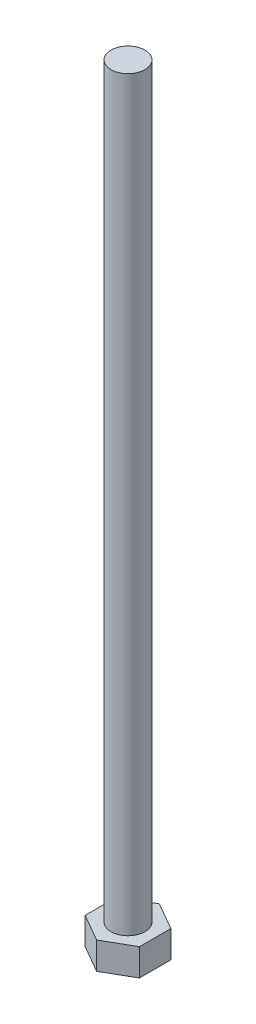
ISO-10303-21;
HEADER;
FILE_DESCRIPTION(('STEP AP214'),'2;1');
FILE_NAME('part.step','',(''),(''),'','','');
FILE_SCHEMA(('AUTOMOTIVE_DESIGN { 1 0 10303 214 1 1 1 1 }'));
ENDSEC;
DATA;
#1=APPLICATION_CONTEXT('core data for automotive mechanical design processes');
#2=APPLICATION_PROTOCOL_DEFINITION('international standard','automotive_design',2000,#1);
#3=PRODUCT_CONTEXT('',#1,'mechanical');
#4=PRODUCT('Part','Part','',(#3));
#5=PRODUCT_RELATED_PRODUCT_CATEGORY('part','',(#4));
#6=PRODUCT_DEFINITION_FORMATION('','',#4);
#7=PRODUCT_DEFINITION_CONTEXT('part definition',#1,'design');
#8=PRODUCT_DEFINITION('design','',#6,#7);
#9=PRODUCT_DEFINITION_SHAPE('','',#8);
#10=(LENGTH_UNIT() NAMED_UNIT(*) SI_UNIT(.MILLI.,.METRE.));
#11=(NAMED_UNIT(*) PLANE_ANGLE_UNIT() SI_UNIT($,.RADIAN.));
#12=(NAMED_UNIT(*) SI_UNIT($,.STERADIAN.) SOLID_ANGLE_UNIT());
#13=UNCERTAINTY_MEASURE_WITH_UNIT(LENGTH_MEASURE(1.E-05),#10,'distance_accuracy_value','');
#14=(GEOMETRIC_REPRESENTATION_CONTEXT(3) GLOBAL_UNCERTAINTY_ASSIGNED_CONTEXT((#13)) GLOBAL_UNIT_ASSIGNED_CONTEXT((#10,
#11,#12)) REPRESENTATION_CONTEXT('',''));
#15=CARTESIAN_POINT('',(0.,0.,0.));
#16=DIRECTION('',(0.,0.,1.));
#17=DIRECTION('',(1.,0.,0.));
#18=AXIS2_PLACEMENT_3D('',#15,#16,#17);
#19=CARTESIAN_POINT('',(0.,4.,4.61880215351705));
#20=DIRECTION('',(-0.499999999999999,0.,-0.866025403784439));
#21=DIRECTION('',(-0.866025403784439,0.,0.499999999999999));
#22=AXIS2_PLACEMENT_3D('',#19,#20,#21);
#23=PLANE('',#22);
#24=DIRECTION('',(0.866025403784439,0.,-0.499999999999999));
#25=VECTOR('',#24,1.);
#26=CARTESIAN_POINT('',(0.,0.,4.61880215351705));
#27=LINE('',#26,#25);
#28=CARTESIAN_POINT('',(0.,0.,4.61880215351705));
#29=VERTEX_POINT('',#28);
#30=CARTESIAN_POINT('',(4.00000000000003,0.,2.30940107675853));
#31=VERTEX_POINT('',#30);
#32=EDGE_CURVE('E119',#29,#31,#27,.T.);
#33=ORIENTED_EDGE('',*,*,#32,.T.);
#34=DIRECTION('',(0.,-1.,0.));
#35=VECTOR('',#34,1.);
#36=CARTESIAN_POINT('',(4.00000000000003,4.,2.30940107675853));
#37=LINE('',#36,#35);
#38=CARTESIAN_POINT('',(4.00000000000003,4.,2.30940107675853));
#39=VERTEX_POINT('',#38);
#40=EDGE_CURVE('E36',#39,#31,#37,.T.);
#41=ORIENTED_EDGE('',*,*,#40,.F.);
#42=DIRECTION('',(0.866025403784439,0.,-0.499999999999999));
#43=VECTOR('',#42,1.);
#44=CARTESIAN_POINT('',(0.,4.,4.61880215351705));
#45=LINE('',#44,#43);
#46=CARTESIAN_POINT('',(0.,4.,4.61880215351705));
#47=VERTEX_POINT('',#46);
#48=EDGE_CURVE('E130',#47,#39,#45,.T.);
#49=ORIENTED_EDGE('',*,*,#48,.F.);
#50=DIRECTION('',(0.,-1.,0.));
#51=VECTOR('',#50,1.);
#52=CARTESIAN_POINT('',(0.,4.,4.61880215351705));
#53=LINE('',#52,#51);
#54=EDGE_CURVE('E115',#47,#29,#53,.T.);
#55=ORIENTED_EDGE('',*,*,#54,.T.);
#56=EDGE_LOOP('',(#33,#41,#49,#55));
#57=FACE_BOUND('',#56,.T.);
#58=ADVANCED_FACE('F33',(#57),#23,.F.);
#59=CARTESIAN_POINT('',(4.00000000000003,4.,2.30940107675853));
#60=DIRECTION('',(-1.,0.,0.));
#61=DIRECTION('',(0.,0.,1.));
#62=AXIS2_PLACEMENT_3D('',#59,#60,#61);
#63=PLANE('',#62);
#64=DIRECTION('',(0.,0.,-1.));
#65=VECTOR('',#64,1.);
#66=CARTESIAN_POINT('',(4.00000000000003,0.,2.30940107675853));
#67=LINE('',#66,#65);
#68=CARTESIAN_POINT('',(4.00000000000004,0.,-2.30940107675852));
#69=VERTEX_POINT('',#68);
#70=EDGE_CURVE('E122',#31,#69,#67,.T.);
#71=ORIENTED_EDGE('',*,*,#70,.T.);
#72=DIRECTION('',(0.,-1.,0.));
#73=VECTOR('',#72,1.);
#74=CARTESIAN_POINT('',(4.00000000000004,4.,-2.30940107675852));
#75=LINE('',#74,#73);
#76=CARTESIAN_POINT('',(4.00000000000004,4.,-2.30940107675852));
#77=VERTEX_POINT('',#76);
#78=EDGE_CURVE('E133',#77,#69,#75,.T.);
#79=ORIENTED_EDGE('',*,*,#78,.F.);
#80=DIRECTION('',(0.,0.,-1.));
#81=VECTOR('',#80,1.);
#82=CARTESIAN_POINT('',(4.00000000000003,4.,2.30940107675853));
#83=LINE('',#82,#81);
#84=EDGE_CURVE('E88',#39,#77,#83,.T.);
#85=ORIENTED_EDGE('',*,*,#84,.F.);
#86=ORIENTED_EDGE('',*,*,#40,.T.);
#87=EDGE_LOOP('',(#71,#79,#85,#86));
#88=FACE_BOUND('',#87,.T.);
#89=ADVANCED_FACE('F138',(#88),#63,.F.);
#90=CARTESIAN_POINT('',(4.00000000000004,4.,-2.30940107675852));
#91=DIRECTION('',(-0.500000000000001,0.,0.866025403784438));
#92=DIRECTION('',(0.866025403784438,0.,0.500000000000001));
#93=AXIS2_PLACEMENT_3D('',#90,#91,#92);
#94=PLANE('',#93);
#95=DIRECTION('',(-0.866025403784438,0.,-0.500000000000001));
#96=VECTOR('',#95,1.);
#97=CARTESIAN_POINT('',(4.00000000000004,0.,-2.30940107675852));
#98=LINE('',#97,#96);
#99=CARTESIAN_POINT('',(0.,0.,-4.61880215351705));
#100=VERTEX_POINT('',#99);
#101=EDGE_CURVE('E125',#69,#100,#98,.T.);
#102=ORIENTED_EDGE('',*,*,#101,.T.);
#103=DIRECTION('',(0.,-1.,0.));
#104=VECTOR('',#103,1.);
#105=CARTESIAN_POINT('',(0.,4.,-4.61880215351705));
#106=LINE('',#105,#104);
#107=CARTESIAN_POINT('',(0.,4.,-4.61880215351705));
#108=VERTEX_POINT('',#107);
#109=EDGE_CURVE('E110',#108,#100,#106,.T.);
#110=ORIENTED_EDGE('',*,*,#109,.F.);
#111=DIRECTION('',(-0.866025403784438,0.,-0.500000000000001));
#112=VECTOR('',#111,1.);
#113=CARTESIAN_POINT('',(4.00000000000004,4.,-2.30940107675852));
#114=LINE('',#113,#112);
#115=EDGE_CURVE('E101',#77,#108,#114,.T.);
#116=ORIENTED_EDGE('',*,*,#115,.F.);
#117=ORIENTED_EDGE('',*,*,#78,.T.);
#118=EDGE_LOOP('',(#102,#110,#116,#117));
#119=FACE_BOUND('',#118,.T.);
#120=ADVANCED_FACE('F144',(#119),#94,.F.);
#121=CARTESIAN_POINT('',(0.,4.,-4.61880215351705));
#122=DIRECTION('',(0.499999999999999,0.,0.866025403784439));
#123=DIRECTION('',(0.866025403784439,0.,-0.499999999999999));
#124=AXIS2_PLACEMENT_3D('',#121,#122,#123);
#125=PLANE('',#124);
#126=DIRECTION('',(-0.866025403784439,0.,0.499999999999999));
#127=VECTOR('',#126,1.);
#128=CARTESIAN_POINT('',(0.,0.,-4.61880215351705));
#129=LINE('',#128,#127);
#130=CARTESIAN_POINT('',(-4.00000000000003,0.,-2.30940107675853));
#131=VERTEX_POINT('',#130);
#132=EDGE_CURVE('E109',#100,#131,#129,.T.);
#133=ORIENTED_EDGE('',*,*,#132,.T.);
#134=DIRECTION('',(0.,-1.,0.));
#135=VECTOR('',#134,1.);
#136=CARTESIAN_POINT('',(-4.00000000000003,4.,-2.30940107675853));
#137=LINE('',#136,#135);
#138=CARTESIAN_POINT('',(-4.00000000000003,4.,-2.30940107675853));
#139=VERTEX_POINT('',#138);
#140=EDGE_CURVE('E106',#139,#131,#137,.T.);
#141=ORIENTED_EDGE('',*,*,#140,.F.);
#142=DIRECTION('',(-0.866025403784439,0.,0.499999999999999));
#143=VECTOR('',#142,1.);
#144=CARTESIAN_POINT('',(0.,4.,-4.61880215351705));
#145=LINE('',#144,#143);
#146=EDGE_CURVE('E95',#108,#139,#145,.T.);
#147=ORIENTED_EDGE('',*,*,#146,.F.);
#148=ORIENTED_EDGE('',*,*,#109,.T.);
#149=EDGE_LOOP('',(#133,#141,#147,#148));
#150=FACE_BOUND('',#149,.T.);
#151=ADVANCED_FACE('F107',(#150),#125,.F.);
#152=CARTESIAN_POINT('',(-4.00000000000003,4.,-2.30940107675853));
#153=DIRECTION('',(1.,0.,0.));
#154=DIRECTION('',(0.,0.,-1.));
#155=AXIS2_PLACEMENT_3D('',#152,#153,#154);
#156=PLANE('',#155);
#157=DIRECTION('',(0.,0.,1.));
#158=VECTOR('',#157,1.);
#159=CARTESIAN_POINT('',(-4.00000000000003,0.,-2.30940107675853));
#160=LINE('',#159,#158);
#161=CARTESIAN_POINT('',(-4.00000000000004,0.,2.30940107675852));
#162=VERTEX_POINT('',#161);
#163=EDGE_CURVE('E73',#131,#162,#160,.T.);
#164=ORIENTED_EDGE('',*,*,#163,.T.);
#165=DIRECTION('',(0.,-1.,0.));
#166=VECTOR('',#165,1.);
#167=CARTESIAN_POINT('',(-4.00000000000004,4.,2.30940107675852));
#168=LINE('',#167,#166);
#169=CARTESIAN_POINT('',(-4.00000000000004,4.,2.30940107675852));
#170=VERTEX_POINT('',#169);
#171=EDGE_CURVE('E111',#170,#162,#168,.T.);
#172=ORIENTED_EDGE('',*,*,#171,.F.);
#173=DIRECTION('',(0.,0.,1.));
#174=VECTOR('',#173,1.);
#175=CARTESIAN_POINT('',(-4.00000000000003,4.,-2.30940107675853));
#176=LINE('',#175,#174);
#177=EDGE_CURVE('E99',#139,#170,#176,.T.);
#178=ORIENTED_EDGE('',*,*,#177,.F.);
#179=ORIENTED_EDGE('',*,*,#140,.T.);
#180=EDGE_LOOP('',(#164,#172,#178,#179));
#181=FACE_BOUND('',#180,.T.);
#182=ADVANCED_FACE('F113',(#181),#156,.F.);
#183=CARTESIAN_POINT('',(-4.00000000000004,4.,2.30940107675852));
#184=DIRECTION('',(0.500000000000001,0.,-0.866025403784438));
#185=DIRECTION('',(-0.866025403784438,0.,-0.500000000000001));
#186=AXIS2_PLACEMENT_3D('',#183,#184,#185);
#187=PLANE('',#186);
#188=DIRECTION('',(0.866025403784438,0.,0.500000000000001));
#189=VECTOR('',#188,1.);
#190=CARTESIAN_POINT('',(-4.00000000000004,0.,2.30940107675852));
#191=LINE('',#190,#189);
#192=EDGE_CURVE('E79',#162,#29,#191,.T.);
#193=ORIENTED_EDGE('',*,*,#192,.T.);
#194=ORIENTED_EDGE('',*,*,#54,.F.);
#195=DIRECTION('',(0.866025403784438,0.,0.500000000000001));
#196=VECTOR('',#195,1.);
#197=CARTESIAN_POINT('',(-4.00000000000004,4.,2.30940107675852));
#198=LINE('',#197,#196);
#199=EDGE_CURVE('E50',#170,#47,#198,.T.);
#200=ORIENTED_EDGE('',*,*,#199,.F.);
#201=ORIENTED_EDGE('',*,*,#171,.T.);
#202=EDGE_LOOP('',(#193,#194,#200,#201));
#203=FACE_BOUND('',#202,.T.);
#204=ADVANCED_FACE('F160',(#203),#187,.F.);
#205=CARTESIAN_POINT('',(0.,4.,0.));
#206=DIRECTION('',(0.,1.,0.));
#207=DIRECTION('',(0.,0.,1.));
#208=AXIS2_PLACEMENT_3D('',#205,#206,#207);
#209=PLANE('',#208);
#210=CARTESIAN_POINT('',(0.,4.,0.));
#211=DIRECTION('',(0.,1.,0.));
#212=DIRECTION('',(0.,0.,1.));
#213=AXIS2_PLACEMENT_3D('',#210,#211,#212);
#214=CIRCLE('',#213,2.5);
#215=CARTESIAN_POINT('',(0.,4.,2.5));
#216=VERTEX_POINT('',#215);
#217=EDGE_CURVE('E11',#216,#216,#214,.T.);
#218=ORIENTED_EDGE('',*,*,#217,.F.);
#219=EDGE_LOOP('',(#218));
#220=FACE_BOUND('',#219,.T.);
#221=ORIENTED_EDGE('',*,*,#48,.T.);
#222=ORIENTED_EDGE('',*,*,#84,.T.);
#223=ORIENTED_EDGE('',*,*,#115,.T.);
#224=ORIENTED_EDGE('',*,*,#146,.T.);
#225=ORIENTED_EDGE('',*,*,#177,.T.);
#226=ORIENTED_EDGE('',*,*,#199,.T.);
#227=EDGE_LOOP('',(#221,#222,#223,#224,#225,#226));
#228=FACE_BOUND('',#227,.T.);
#229=ADVANCED_FACE('F97',(#220,#228),#209,.T.);
#230=CARTESIAN_POINT('',(0.,0.,0.));
#231=DIRECTION('',(0.,1.,0.));
#232=DIRECTION('',(0.,0.,1.));
#233=AXIS2_PLACEMENT_3D('',#230,#231,#232);
#234=PLANE('',#233);
#235=ORIENTED_EDGE('',*,*,#32,.F.);
#236=ORIENTED_EDGE('',*,*,#192,.F.);
#237=ORIENTED_EDGE('',*,*,#163,.F.);
#238=ORIENTED_EDGE('',*,*,#132,.F.);
#239=ORIENTED_EDGE('',*,*,#101,.F.);
#240=ORIENTED_EDGE('',*,*,#70,.F.);
#241=EDGE_LOOP('',(#235,#236,#237,#238,#239,#240));
#242=FACE_BOUND('',#241,.T.);
#243=ADVANCED_FACE('F143',(#242),#234,.F.);
#244=CARTESIAN_POINT('',(0.,114.,0.));
#245=DIRECTION('',(0.,-1.,0.));
#246=DIRECTION('',(0.,0.,-1.));
#247=AXIS2_PLACEMENT_3D('',#244,#245,#246);
#248=CYLINDRICAL_SURFACE('',#247,2.5);
#249=CARTESIAN_POINT('',(0.,114.,0.));
#250=DIRECTION('',(0.,1.,0.));
#251=DIRECTION('',(0.,0.,1.));
#252=AXIS2_PLACEMENT_3D('',#249,#250,#251);
#253=CIRCLE('',#252,2.5);
#254=CARTESIAN_POINT('',(0.,114.,2.5));
#255=VERTEX_POINT('',#254);
#256=EDGE_CURVE('E123',#255,#255,#253,.T.);
#257=ORIENTED_EDGE('',*,*,#256,.F.);
#258=EDGE_LOOP('',(#257));
#259=FACE_BOUND('',#258,.T.);
#260=ORIENTED_EDGE('',*,*,#217,.T.);
#261=EDGE_LOOP('',(#260));
#262=FACE_BOUND('',#261,.T.);
#263=ADVANCED_FACE('F153',(#259,#262),#248,.T.);
#264=CARTESIAN_POINT('',(0.,114.,0.));
#265=DIRECTION('',(0.,1.,0.));
#266=DIRECTION('',(0.,0.,1.));
#267=AXIS2_PLACEMENT_3D('',#264,#265,#266);
#268=PLANE('',#267);
#269=ORIENTED_EDGE('',*,*,#256,.T.);
#270=EDGE_LOOP('',(#269));
#271=FACE_BOUND('',#270,.T.);
#272=ADVANCED_FACE('F151',(#271),#268,.T.);
#273=CLOSED_SHELL('',(#58,#89,#120,#151,#182,#204,#229,#243,#263,#272));
#274=MANIFOLD_SOLID_BREP('B2',#273);
#275=ADVANCED_BREP_SHAPE_REPRESENTATION('',(#18,#274),#14);
#276=SHAPE_DEFINITION_REPRESENTATION(#9,#275);
ENDSEC;
END-ISO-10303-21;
